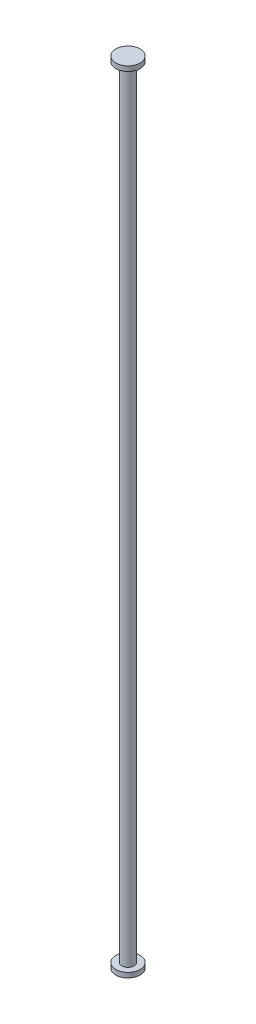
ISO-10303-21;
HEADER;
FILE_DESCRIPTION(('STEP AP214'),'2;1');
FILE_NAME('part.step','',(''),(''),'','','');
FILE_SCHEMA(('AUTOMOTIVE_DESIGN { 1 0 10303 214 1 1 1 1 }'));
ENDSEC;
DATA;
#1=APPLICATION_CONTEXT('core data for automotive mechanical design processes');
#2=APPLICATION_PROTOCOL_DEFINITION('international standard','automotive_design',2000,#1);
#3=PRODUCT_CONTEXT('',#1,'mechanical');
#4=PRODUCT('Part','Part','',(#3));
#5=PRODUCT_RELATED_PRODUCT_CATEGORY('part','',(#4));
#6=PRODUCT_DEFINITION_FORMATION('','',#4);
#7=PRODUCT_DEFINITION_CONTEXT('part definition',#1,'design');
#8=PRODUCT_DEFINITION('design','',#6,#7);
#9=PRODUCT_DEFINITION_SHAPE('','',#8);
#10=(LENGTH_UNIT() NAMED_UNIT(*) SI_UNIT(.MILLI.,.METRE.));
#11=(NAMED_UNIT(*) PLANE_ANGLE_UNIT() SI_UNIT($,.RADIAN.));
#12=(NAMED_UNIT(*) SI_UNIT($,.STERADIAN.) SOLID_ANGLE_UNIT());
#13=UNCERTAINTY_MEASURE_WITH_UNIT(LENGTH_MEASURE(1.E-05),#10,'distance_accuracy_value','');
#14=(GEOMETRIC_REPRESENTATION_CONTEXT(3) GLOBAL_UNCERTAINTY_ASSIGNED_CONTEXT((#13)) GLOBAL_UNIT_ASSIGNED_CONTEXT((#10,
#11,#12)) REPRESENTATION_CONTEXT('',''));
#15=CARTESIAN_POINT('',(0.,0.,0.));
#16=DIRECTION('',(0.,0.,1.));
#17=DIRECTION('',(1.,0.,0.));
#18=AXIS2_PLACEMENT_3D('',#15,#16,#17);
#19=CARTESIAN_POINT('',(0.,320.,0.));
#20=DIRECTION('',(0.,-1.,0.));
#21=DIRECTION('',(0.,0.,-1.));
#22=AXIS2_PLACEMENT_3D('',#19,#20,#21);
#23=CYLINDRICAL_SURFACE('',#22,2.5);
#24=CARTESIAN_POINT('',(0.,320.,0.));
#25=DIRECTION('',(0.,1.,0.));
#26=DIRECTION('',(0.,0.,1.));
#27=AXIS2_PLACEMENT_3D('',#24,#25,#26);
#28=CIRCLE('',#27,2.5);
#29=CARTESIAN_POINT('',(0.,320.,2.5));
#30=VERTEX_POINT('',#29);
#31=EDGE_CURVE('E10',#30,#30,#28,.T.);
#32=ORIENTED_EDGE('',*,*,#31,.F.);
#33=EDGE_LOOP('',(#32));
#34=FACE_BOUND('',#33,.T.);
#35=CARTESIAN_POINT('',(0.,0.,0.));
#36=DIRECTION('',(0.,-1.,0.));
#37=DIRECTION('',(0.,0.,-1.));
#38=AXIS2_PLACEMENT_3D('',#35,#36,#37);
#39=CIRCLE('',#38,2.5);
#40=CARTESIAN_POINT('',(0.,0.,-2.5));
#41=VERTEX_POINT('',#40);
#42=EDGE_CURVE('E37',#41,#41,#39,.T.);
#43=ORIENTED_EDGE('',*,*,#42,.F.);
#44=EDGE_LOOP('',(#43));
#45=FACE_BOUND('',#44,.T.);
#46=ADVANCED_FACE('F31',(#34,#45),#23,.T.);
#47=CARTESIAN_POINT('',(0.,0.,0.));
#48=DIRECTION('',(0.,-1.,0.));
#49=DIRECTION('',(0.,0.,-1.));
#50=AXIS2_PLACEMENT_3D('',#47,#48,#49);
#51=PLANE('',#50);
#52=CARTESIAN_POINT('',(0.,0.,0.));
#53=DIRECTION('',(0.,-1.,0.));
#54=DIRECTION('',(0.,0.,-1.));
#55=AXIS2_PLACEMENT_3D('',#52,#53,#54);
#56=CIRCLE('',#55,5.);
#57=CARTESIAN_POINT('',(0.,0.,-5.));
#58=VERTEX_POINT('',#57);
#59=EDGE_CURVE('E45',#58,#58,#56,.T.);
#60=ORIENTED_EDGE('',*,*,#59,.F.);
#61=EDGE_LOOP('',(#60));
#62=FACE_BOUND('',#61,.T.);
#63=ORIENTED_EDGE('',*,*,#42,.T.);
#64=EDGE_LOOP('',(#63));
#65=FACE_BOUND('',#64,.T.);
#66=ADVANCED_FACE('F77',(#62,#65),#51,.F.);
#67=CARTESIAN_POINT('',(0.,-2.,0.));
#68=DIRECTION('',(0.,1.,0.));
#69=DIRECTION('',(0.,0.,1.));
#70=AXIS2_PLACEMENT_3D('',#67,#68,#69);
#71=CYLINDRICAL_SURFACE('',#70,5.);
#72=CARTESIAN_POINT('',(0.,-2.,0.));
#73=DIRECTION('',(0.,-1.,0.));
#74=DIRECTION('',(0.,0.,-1.));
#75=AXIS2_PLACEMENT_3D('',#72,#73,#74);
#76=CIRCLE('',#75,5.);
#77=CARTESIAN_POINT('',(0.,-2.,-5.));
#78=VERTEX_POINT('',#77);
#79=EDGE_CURVE('E41',#78,#78,#76,.T.);
#80=ORIENTED_EDGE('',*,*,#79,.F.);
#81=EDGE_LOOP('',(#80));
#82=FACE_BOUND('',#81,.T.);
#83=ORIENTED_EDGE('',*,*,#59,.T.);
#84=EDGE_LOOP('',(#83));
#85=FACE_BOUND('',#84,.T.);
#86=ADVANCED_FACE('F72',(#82,#85),#71,.T.);
#87=CARTESIAN_POINT('',(0.,-2.,0.));
#88=DIRECTION('',(0.,-1.,0.));
#89=DIRECTION('',(0.,0.,-1.));
#90=AXIS2_PLACEMENT_3D('',#87,#88,#89);
#91=PLANE('',#90);
#92=ORIENTED_EDGE('',*,*,#79,.T.);
#93=EDGE_LOOP('',(#92));
#94=FACE_BOUND('',#93,.T.);
#95=ADVANCED_FACE('F67',(#94),#91,.T.);
#96=CARTESIAN_POINT('',(0.,320.,0.));
#97=DIRECTION('',(0.,1.,0.));
#98=DIRECTION('',(0.,0.,1.));
#99=AXIS2_PLACEMENT_3D('',#96,#97,#98);
#100=PLANE('',#99);
#101=CARTESIAN_POINT('',(0.,320.,0.));
#102=DIRECTION('',(0.,1.,0.));
#103=DIRECTION('',(0.,0.,1.));
#104=AXIS2_PLACEMENT_3D('',#101,#102,#103);
#105=CIRCLE('',#104,5.);
#106=CARTESIAN_POINT('',(0.,320.,5.));
#107=VERTEX_POINT('',#106);
#108=EDGE_CURVE('E51',#107,#107,#105,.T.);
#109=ORIENTED_EDGE('',*,*,#108,.F.);
#110=EDGE_LOOP('',(#109));
#111=FACE_BOUND('',#110,.T.);
#112=ORIENTED_EDGE('',*,*,#31,.T.);
#113=EDGE_LOOP('',(#112));
#114=FACE_BOUND('',#113,.T.);
#115=ADVANCED_FACE('F62',(#111,#114),#100,.F.);
#116=CARTESIAN_POINT('',(0.,322.,0.));
#117=DIRECTION('',(0.,-1.,0.));
#118=DIRECTION('',(0.,0.,-1.));
#119=AXIS2_PLACEMENT_3D('',#116,#117,#118);
#120=CYLINDRICAL_SURFACE('',#119,5.);
#121=CARTESIAN_POINT('',(0.,322.,0.));
#122=DIRECTION('',(0.,1.,0.));
#123=DIRECTION('',(0.,0.,1.));
#124=AXIS2_PLACEMENT_3D('',#121,#122,#123);
#125=CIRCLE('',#124,5.);
#126=CARTESIAN_POINT('',(0.,322.,5.));
#127=VERTEX_POINT('',#126);
#128=EDGE_CURVE('E49',#127,#127,#125,.T.);
#129=ORIENTED_EDGE('',*,*,#128,.F.);
#130=EDGE_LOOP('',(#129));
#131=FACE_BOUND('',#130,.T.);
#132=ORIENTED_EDGE('',*,*,#108,.T.);
#133=EDGE_LOOP('',(#132));
#134=FACE_BOUND('',#133,.T.);
#135=ADVANCED_FACE('F59',(#131,#134),#120,.T.);
#136=CARTESIAN_POINT('',(0.,322.,0.));
#137=DIRECTION('',(0.,1.,0.));
#138=DIRECTION('',(0.,0.,1.));
#139=AXIS2_PLACEMENT_3D('',#136,#137,#138);
#140=PLANE('',#139);
#141=ORIENTED_EDGE('',*,*,#128,.T.);
#142=EDGE_LOOP('',(#141));
#143=FACE_BOUND('',#142,.T.);
#144=ADVANCED_FACE('F57',(#143),#140,.T.);
#145=CLOSED_SHELL('',(#46,#66,#86,#95,#115,#135,#144));
#146=MANIFOLD_SOLID_BREP('B2',#145);
#147=ADVANCED_BREP_SHAPE_REPRESENTATION('',(#18,#146),#14);
#148=SHAPE_DEFINITION_REPRESENTATION(#9,#147);
ENDSEC;
END-ISO-10303-21;
